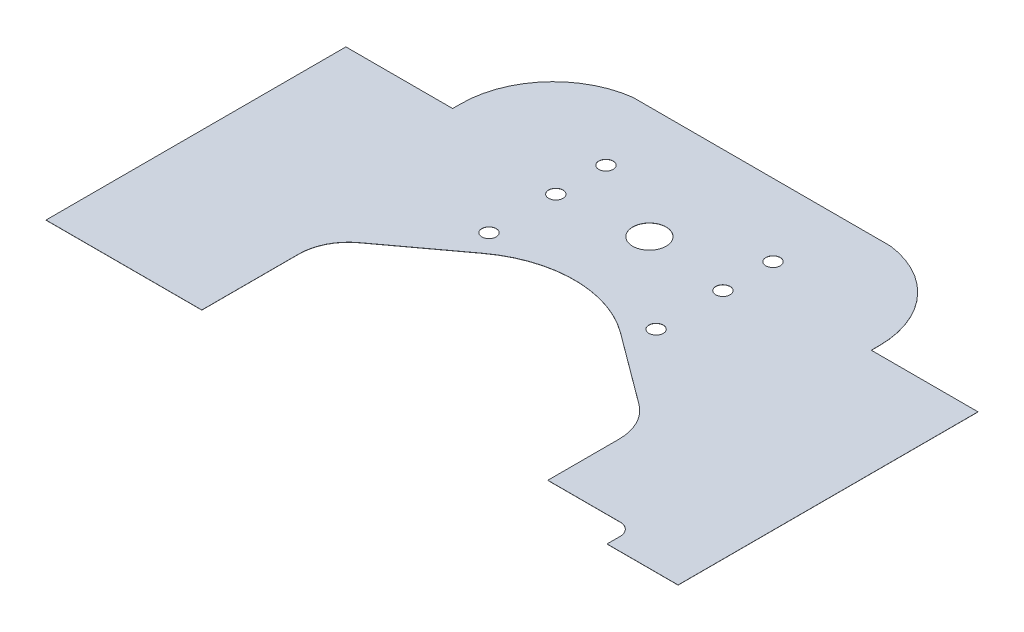
ISO-10303-21;
HEADER;
FILE_DESCRIPTION(('STEP AP214'),'2;1');
FILE_NAME('part.step','',(''),(''),'','','');
FILE_SCHEMA(('AUTOMOTIVE_DESIGN { 1 0 10303 214 1 1 1 1 }'));
ENDSEC;
DATA;
#1=APPLICATION_CONTEXT('core data for automotive mechanical design processes');
#2=APPLICATION_PROTOCOL_DEFINITION('international standard','automotive_design',2000,#1);
#3=PRODUCT_CONTEXT('',#1,'mechanical');
#4=PRODUCT('Part','Part','',(#3));
#5=PRODUCT_RELATED_PRODUCT_CATEGORY('part','',(#4));
#6=PRODUCT_DEFINITION_FORMATION('','',#4);
#7=PRODUCT_DEFINITION_CONTEXT('part definition',#1,'design');
#8=PRODUCT_DEFINITION('design','',#6,#7);
#9=PRODUCT_DEFINITION_SHAPE('','',#8);
#10=(LENGTH_UNIT() NAMED_UNIT(*) SI_UNIT(.MILLI.,.METRE.));
#11=(NAMED_UNIT(*) PLANE_ANGLE_UNIT() SI_UNIT($,.RADIAN.));
#12=(NAMED_UNIT(*) SI_UNIT($,.STERADIAN.) SOLID_ANGLE_UNIT());
#13=UNCERTAINTY_MEASURE_WITH_UNIT(LENGTH_MEASURE(1.E-05),#10,'distance_accuracy_value','');
#14=(GEOMETRIC_REPRESENTATION_CONTEXT(3) GLOBAL_UNCERTAINTY_ASSIGNED_CONTEXT((#13)) GLOBAL_UNIT_ASSIGNED_CONTEXT((#10,
#11,#12)) REPRESENTATION_CONTEXT('',''));
#15=CARTESIAN_POINT('',(0.,0.,0.));
#16=DIRECTION('',(0.,0.,1.));
#17=DIRECTION('',(1.,0.,0.));
#18=AXIS2_PLACEMENT_3D('',#15,#16,#17);
#19=CARTESIAN_POINT('',(44.2056152255693,0.0254,52.1025238036352));
#20=DIRECTION('',(0.,1.,0.));
#21=DIRECTION('',(0.,0.,1.));
#22=AXIS2_PLACEMENT_3D('',#19,#20,#21);
#23=PLANE('',#22);
#24=DIRECTION('',(-1.,0.,0.));
#25=VECTOR('',#24,1.);
#26=CARTESIAN_POINT('',(-60.06,0.0254,54.6058051868823));
#27=LINE('',#26,#25);
#28=CARTESIAN_POINT('',(-30.448964566714,0.0254,54.6058051868823));
#29=VERTEX_POINT('',#28);
#30=CARTESIAN_POINT('',(-60.06,0.0254,54.6058051868823));
#31=VERTEX_POINT('',#30);
#32=EDGE_CURVE('E46',#29,#31,#27,.T.);
#33=ORIENTED_EDGE('',*,*,#32,.F.);
#34=DIRECTION('',(0.,0.,1.));
#35=VECTOR('',#34,1.);
#36=CARTESIAN_POINT('',(-30.448964566714,0.0254,54.6058051868823));
#37=LINE('',#36,#35);
#38=CARTESIAN_POINT('',(-30.4489645667141,0.0254,36.195));
#39=VERTEX_POINT('',#38);
#40=EDGE_CURVE('E281',#39,#29,#37,.T.);
#41=ORIENTED_EDGE('',*,*,#40,.F.);
#42=CARTESIAN_POINT('',(-21.,0.0254,36.195));
#43=DIRECTION('',(0.,1.,0.));
#44=DIRECTION('',(0.,0.,1.));
#45=AXIS2_PLACEMENT_3D('',#42,#43,#44);
#46=CIRCLE('',#45,9.44896456671407);
#47=CARTESIAN_POINT('',(-26.6243836706632,0.0254,28.6022903579686));
#48=VERTEX_POINT('',#47);
#49=EDGE_CURVE('E284',#48,#39,#46,.T.);
#50=ORIENTED_EDGE('',*,*,#49,.F.);
#51=DIRECTION('',(-0.803549382413627,0.,0.595238095238098));
#52=VECTOR('',#51,1.);
#53=CARTESIAN_POINT('',(-26.6243836706632,0.0254,28.6022903579686));
#54=LINE('',#53,#52);
#55=CARTESIAN_POINT('',(-13.0648598611394,0.0254,18.5579230777982));
#56=VERTEX_POINT('',#55);
#57=EDGE_CURVE('E287',#56,#48,#54,.T.);
#58=ORIENTED_EDGE('',*,*,#57,.F.);
#59=CARTESIAN_POINT('',(0.,0.0254,36.195));
#60=DIRECTION('',(0.,1.,0.));
#61=DIRECTION('',(0.,0.,1.));
#62=AXIS2_PLACEMENT_3D('',#59,#60,#61);
#63=CIRCLE('',#62,21.9489645667142);
#64=CARTESIAN_POINT('',(13.0648598611394,0.0254,18.5579230777982));
#65=VERTEX_POINT('',#64);
#66=EDGE_CURVE('E290',#65,#56,#63,.T.);
#67=ORIENTED_EDGE('',*,*,#66,.F.);
#68=DIRECTION('',(-0.80354938241363,0.,-0.595238095238094));
#69=VECTOR('',#68,1.);
#70=CARTESIAN_POINT('',(13.0648598611394,0.0254,18.5579230777982));
#71=LINE('',#70,#69);
#72=CARTESIAN_POINT('',(26.6243836706632,0.0254,28.6022903579686));
#73=VERTEX_POINT('',#72);
#74=EDGE_CURVE('E293',#73,#65,#71,.T.);
#75=ORIENTED_EDGE('',*,*,#74,.F.);
#76=CARTESIAN_POINT('',(21.,0.0254,36.195));
#77=DIRECTION('',(0.,1.,0.));
#78=DIRECTION('',(0.,0.,1.));
#79=AXIS2_PLACEMENT_3D('',#76,#77,#78);
#80=CIRCLE('',#79,9.44896456671417);
#81=CARTESIAN_POINT('',(30.4489645667142,0.0254,36.195));
#82=VERTEX_POINT('',#81);
#83=EDGE_CURVE('E296',#82,#73,#80,.T.);
#84=ORIENTED_EDGE('',*,*,#83,.F.);
#85=DIRECTION('',(0.,0.,-1.));
#86=VECTOR('',#85,1.);
#87=CARTESIAN_POINT('',(30.4489645667142,0.0254,36.195));
#88=LINE('',#87,#86);
#89=CARTESIAN_POINT('',(30.4489645667141,0.0254,49.7525578130592));
#90=VERTEX_POINT('',#89);
#91=EDGE_CURVE('E299',#90,#82,#88,.T.);
#92=ORIENTED_EDGE('',*,*,#91,.F.);
#93=DIRECTION('',(-1.,0.,0.));
#94=VECTOR('',#93,1.);
#95=CARTESIAN_POINT('',(30.4489645667141,0.0254,49.7525578130592));
#96=LINE('',#95,#94);
#97=CARTESIAN_POINT('',(44.2056152255693,0.0254,49.7525578130594));
#98=VERTEX_POINT('',#97);
#99=EDGE_CURVE('E302',#98,#90,#96,.T.);
#100=ORIENTED_EDGE('',*,*,#99,.F.);
#101=CARTESIAN_POINT('',(44.2056152255693,0.0254,52.1025238036352));
#102=DIRECTION('',(0.,1.,0.));
#103=DIRECTION('',(0.,0.,1.));
#104=AXIS2_PLACEMENT_3D('',#101,#102,#103);
#105=CIRCLE('',#104,2.34996599057581);
#106=CARTESIAN_POINT('',(46.5555812161449,0.0254,52.102523803633));
#107=VERTEX_POINT('',#106);
#108=EDGE_CURVE('E305',#107,#98,#105,.T.);
#109=ORIENTED_EDGE('',*,*,#108,.F.);
#110=DIRECTION('',(1.71858994726284E-13,0.,-1.));
#111=VECTOR('',#110,1.);
#112=CARTESIAN_POINT('',(46.5555812161449,0.0254,52.102523803633));
#113=LINE('',#112,#111);
#114=CARTESIAN_POINT('',(46.5555812161444,0.0254,54.6058051868823));
#115=VERTEX_POINT('',#114);
#116=EDGE_CURVE('E308',#115,#107,#113,.T.);
#117=ORIENTED_EDGE('',*,*,#116,.F.);
#118=DIRECTION('',(-1.,0.,0.));
#119=VECTOR('',#118,1.);
#120=CARTESIAN_POINT('',(46.5555812161444,0.0254,54.6058051868823));
#121=LINE('',#120,#119);
#122=CARTESIAN_POINT('',(60.0599999999974,0.0254,54.6058051868823));
#123=VERTEX_POINT('',#122);
#124=EDGE_CURVE('E311',#123,#115,#121,.T.);
#125=ORIENTED_EDGE('',*,*,#124,.F.);
#126=DIRECTION('',(0.,0.,-1.));
#127=VECTOR('',#126,1.);
#128=CARTESIAN_POINT('',(60.0599999999974,0.0254,55.1058051868806));
#129=LINE('',#128,#127);
#130=CARTESIAN_POINT('',(60.0599999999974,0.0254,-2.38250000000009));
#131=VERTEX_POINT('',#130);
#132=EDGE_CURVE('E96',#123,#131,#129,.T.);
#133=ORIENTED_EDGE('',*,*,#132,.T.);
#134=DIRECTION('',(-1.,0.,0.));
#135=VECTOR('',#134,1.);
#136=CARTESIAN_POINT('',(60.0599999999974,0.0254,-2.38250000000009));
#137=LINE('',#136,#135);
#138=CARTESIAN_POINT('',(39.775,0.0254,-2.38250000000009));
#139=VERTEX_POINT('',#138);
#140=EDGE_CURVE('E197',#131,#139,#137,.T.);
#141=ORIENTED_EDGE('',*,*,#140,.T.);
#142=DIRECTION('',(0.,0.,-1.));
#143=VECTOR('',#142,1.);
#144=CARTESIAN_POINT('',(39.775,0.0254,-2.38250000000009));
#145=LINE('',#144,#143);
#146=CARTESIAN_POINT('',(39.775,0.0254,-3.94250000000058));
#147=VERTEX_POINT('',#146);
#148=EDGE_CURVE('E176',#139,#147,#145,.T.);
#149=ORIENTED_EDGE('',*,*,#148,.T.);
#150=CARTESIAN_POINT('',(22.225,0.0254,-3.94250000000058));
#151=DIRECTION('',(0.,1.,0.));
#152=DIRECTION('',(0.,0.,1.));
#153=AXIS2_PLACEMENT_3D('',#150,#151,#152);
#154=CIRCLE('',#153,17.55);
#155=CARTESIAN_POINT('',(24.4755336439552,0.0254,-21.3476026517354));
#156=VERTEX_POINT('',#155);
#157=EDGE_CURVE('E193',#147,#156,#154,.T.);
#158=ORIENTED_EDGE('',*,*,#157,.T.);
#159=DIRECTION('',(-1.,0.,0.));
#160=VECTOR('',#159,1.);
#161=CARTESIAN_POINT('',(-24.4755336439552,0.0254,-21.3476026517354));
#162=LINE('',#161,#160);
#163=CARTESIAN_POINT('',(-24.4755336439552,0.0254,-21.3476026517354));
#164=VERTEX_POINT('',#163);
#165=EDGE_CURVE('E120',#156,#164,#162,.T.);
#166=ORIENTED_EDGE('',*,*,#165,.T.);
#167=CARTESIAN_POINT('',(-22.225,0.0254,-3.94250000000058));
#168=DIRECTION('',(0.,1.,0.));
#169=DIRECTION('',(0.,0.,1.));
#170=AXIS2_PLACEMENT_3D('',#167,#168,#169);
#171=CIRCLE('',#170,17.55);
#172=CARTESIAN_POINT('',(-39.775,0.0254,-3.94250000000059));
#173=VERTEX_POINT('',#172);
#174=EDGE_CURVE('E113',#164,#173,#171,.T.);
#175=ORIENTED_EDGE('',*,*,#174,.T.);
#176=DIRECTION('',(0.,0.,1.));
#177=VECTOR('',#176,1.);
#178=CARTESIAN_POINT('',(-39.775,0.0254,-3.94250000000058));
#179=LINE('',#178,#177);
#180=CARTESIAN_POINT('',(-39.775,0.0254,-2.38250000000009));
#181=VERTEX_POINT('',#180);
#182=EDGE_CURVE('E117',#173,#181,#179,.T.);
#183=ORIENTED_EDGE('',*,*,#182,.T.);
#184=DIRECTION('',(-1.,0.,0.));
#185=VECTOR('',#184,1.);
#186=CARTESIAN_POINT('',(-39.775,0.0254,-2.38250000000009));
#187=LINE('',#186,#185);
#188=CARTESIAN_POINT('',(-60.06,0.0254,-2.38250000000009));
#189=VERTEX_POINT('',#188);
#190=EDGE_CURVE('E55',#181,#189,#187,.T.);
#191=ORIENTED_EDGE('',*,*,#190,.T.);
#192=DIRECTION('',(0.,0.,1.));
#193=VECTOR('',#192,1.);
#194=CARTESIAN_POINT('',(-60.06,0.0254,-2.38250000000009));
#195=LINE('',#194,#193);
#196=EDGE_CURVE('E137',#189,#31,#195,.T.);
#197=ORIENTED_EDGE('',*,*,#196,.T.);
#198=EDGE_LOOP('',(#33,#41,#50,#58,#67,#75,#84,#92,#100,#109,#117,#125,#133,#141,#149,#158,#166,
#175,#183,#191,#197));
#199=FACE_BOUND('',#198,.T.);
#200=CARTESIAN_POINT('',(15.875,0.0254,-7.62000000000004));
#201=DIRECTION('',(0.,1.,0.));
#202=DIRECTION('',(0.,0.,1.));
#203=AXIS2_PLACEMENT_3D('',#200,#201,#202);
#204=CIRCLE('',#203,1.36999999999998);
#205=CARTESIAN_POINT('',(15.875,0.0254,-6.25000000000006));
#206=VERTEX_POINT('',#205);
#207=EDGE_CURVE('E227',#206,#206,#204,.T.);
#208=ORIENTED_EDGE('',*,*,#207,.F.);
#209=EDGE_LOOP('',(#208));
#210=FACE_BOUND('',#209,.T.);
#211=CARTESIAN_POINT('',(0.,0.0254,0.));
#212=DIRECTION('',(0.,1.,0.));
#213=DIRECTION('',(0.,0.,1.));
#214=AXIS2_PLACEMENT_3D('',#211,#212,#213);
#215=CIRCLE('',#214,3.175);
#216=CARTESIAN_POINT('',(0.,0.0254,3.175));
#217=VERTEX_POINT('',#216);
#218=EDGE_CURVE('E215',#217,#217,#215,.T.);
#219=ORIENTED_EDGE('',*,*,#218,.F.);
#220=EDGE_LOOP('',(#219));
#221=FACE_BOUND('',#220,.T.);
#222=CARTESIAN_POINT('',(-15.875,0.0254,-7.62000000000004));
#223=DIRECTION('',(0.,1.,0.));
#224=DIRECTION('',(0.,0.,1.));
#225=AXIS2_PLACEMENT_3D('',#222,#223,#224);
#226=CIRCLE('',#225,1.37);
#227=CARTESIAN_POINT('',(-15.875,0.0254,-6.25000000000005));
#228=VERTEX_POINT('',#227);
#229=EDGE_CURVE('E203',#228,#228,#226,.T.);
#230=ORIENTED_EDGE('',*,*,#229,.F.);
#231=EDGE_LOOP('',(#230));
#232=FACE_BOUND('',#231,.T.);
#233=CARTESIAN_POINT('',(-15.875,0.0254,1.90499999999996));
#234=DIRECTION('',(0.,1.,0.));
#235=DIRECTION('',(0.,0.,1.));
#236=AXIS2_PLACEMENT_3D('',#233,#234,#235);
#237=CIRCLE('',#236,1.37);
#238=CARTESIAN_POINT('',(-15.875,0.0254,3.27499999999996));
#239=VERTEX_POINT('',#238);
#240=EDGE_CURVE('E146',#239,#239,#237,.T.);
#241=ORIENTED_EDGE('',*,*,#240,.F.);
#242=EDGE_LOOP('',(#241));
#243=FACE_BOUND('',#242,.T.);
#244=CARTESIAN_POINT('',(-15.875,0.0254,14.605));
#245=DIRECTION('',(0.,1.,0.));
#246=DIRECTION('',(0.,0.,1.));
#247=AXIS2_PLACEMENT_3D('',#244,#245,#246);
#248=CIRCLE('',#247,1.37);
#249=CARTESIAN_POINT('',(-15.875,0.0254,15.975));
#250=VERTEX_POINT('',#249);
#251=EDGE_CURVE('E209',#250,#250,#248,.T.);
#252=ORIENTED_EDGE('',*,*,#251,.F.);
#253=EDGE_LOOP('',(#252));
#254=FACE_BOUND('',#253,.T.);
#255=CARTESIAN_POINT('',(15.875,0.0254,1.90499999999996));
#256=DIRECTION('',(0.,1.,0.));
#257=DIRECTION('',(0.,0.,1.));
#258=AXIS2_PLACEMENT_3D('',#255,#256,#257);
#259=CIRCLE('',#258,1.36999999999998);
#260=CARTESIAN_POINT('',(15.875,0.0254,3.27499999999995));
#261=VERTEX_POINT('',#260);
#262=EDGE_CURVE('E221',#261,#261,#259,.T.);
#263=ORIENTED_EDGE('',*,*,#262,.F.);
#264=EDGE_LOOP('',(#263));
#265=FACE_BOUND('',#264,.T.);
#266=CARTESIAN_POINT('',(15.875,0.0254,14.605));
#267=DIRECTION('',(0.,1.,0.));
#268=DIRECTION('',(0.,0.,1.));
#269=AXIS2_PLACEMENT_3D('',#266,#267,#268);
#270=CIRCLE('',#269,1.36999999999998);
#271=CARTESIAN_POINT('',(15.875,0.0254,15.975));
#272=VERTEX_POINT('',#271);
#273=EDGE_CURVE('E233',#272,#272,#270,.T.);
#274=ORIENTED_EDGE('',*,*,#273,.F.);
#275=EDGE_LOOP('',(#274));
#276=FACE_BOUND('',#275,.T.);
#277=ADVANCED_FACE('F31',(#199,#210,#221,#232,#243,#254,#265,#276),#23,.T.);
#278=CARTESIAN_POINT('',(44.2056152255693,0.,52.1025238036352));
#279=DIRECTION('',(0.,1.,0.));
#280=DIRECTION('',(0.,0.,1.));
#281=AXIS2_PLACEMENT_3D('',#278,#279,#280);
#282=PLANE('',#281);
#283=CARTESIAN_POINT('',(15.875,0.,-7.62000000000004));
#284=DIRECTION('',(0.,1.,0.));
#285=DIRECTION('',(0.,0.,1.));
#286=AXIS2_PLACEMENT_3D('',#283,#284,#285);
#287=CIRCLE('',#286,1.36999999999998);
#288=CARTESIAN_POINT('',(15.875,0.,-6.25000000000006));
#289=VERTEX_POINT('',#288);
#290=EDGE_CURVE('E230',#289,#289,#287,.T.);
#291=ORIENTED_EDGE('',*,*,#290,.T.);
#292=EDGE_LOOP('',(#291));
#293=FACE_BOUND('',#292,.T.);
#294=CARTESIAN_POINT('',(0.,0.,0.));
#295=DIRECTION('',(0.,1.,0.));
#296=DIRECTION('',(0.,0.,1.));
#297=AXIS2_PLACEMENT_3D('',#294,#295,#296);
#298=CIRCLE('',#297,3.175);
#299=CARTESIAN_POINT('',(0.,0.,3.175));
#300=VERTEX_POINT('',#299);
#301=EDGE_CURVE('E218',#300,#300,#298,.T.);
#302=ORIENTED_EDGE('',*,*,#301,.T.);
#303=EDGE_LOOP('',(#302));
#304=FACE_BOUND('',#303,.T.);
#305=CARTESIAN_POINT('',(-15.875,0.,-7.62000000000004));
#306=DIRECTION('',(0.,1.,0.));
#307=DIRECTION('',(0.,0.,1.));
#308=AXIS2_PLACEMENT_3D('',#305,#306,#307);
#309=CIRCLE('',#308,1.37);
#310=CARTESIAN_POINT('',(-15.875,0.,-6.25000000000005));
#311=VERTEX_POINT('',#310);
#312=EDGE_CURVE('E206',#311,#311,#309,.T.);
#313=ORIENTED_EDGE('',*,*,#312,.T.);
#314=EDGE_LOOP('',(#313));
#315=FACE_BOUND('',#314,.T.);
#316=DIRECTION('',(0.,0.,1.));
#317=VECTOR('',#316,1.);
#318=CARTESIAN_POINT('',(-30.448964566714,0.,54.6058051868823));
#319=LINE('',#318,#317);
#320=CARTESIAN_POINT('',(-30.4489645667141,0.,36.195));
#321=VERTEX_POINT('',#320);
#322=CARTESIAN_POINT('',(-30.448964566714,0.,54.6058051868823));
#323=VERTEX_POINT('',#322);
#324=EDGE_CURVE('E316',#321,#323,#319,.T.);
#325=ORIENTED_EDGE('',*,*,#324,.T.);
#326=DIRECTION('',(-1.,0.,0.));
#327=VECTOR('',#326,1.);
#328=CARTESIAN_POINT('',(-60.06,0.,54.6058051868823));
#329=LINE('',#328,#327);
#330=CARTESIAN_POINT('',(-60.06,0.,54.6058051868823));
#331=VERTEX_POINT('',#330);
#332=EDGE_CURVE('E246',#323,#331,#329,.T.);
#333=ORIENTED_EDGE('',*,*,#332,.T.);
#334=DIRECTION('',(0.,0.,1.));
#335=VECTOR('',#334,1.);
#336=CARTESIAN_POINT('',(-60.06,0.,-2.38250000000009));
#337=LINE('',#336,#335);
#338=CARTESIAN_POINT('',(-60.06,0.,-2.38250000000009));
#339=VERTEX_POINT('',#338);
#340=EDGE_CURVE('E158',#339,#331,#337,.T.);
#341=ORIENTED_EDGE('',*,*,#340,.F.);
#342=DIRECTION('',(-1.,0.,0.));
#343=VECTOR('',#342,1.);
#344=CARTESIAN_POINT('',(-39.775,0.,-2.38250000000009));
#345=LINE('',#344,#343);
#346=CARTESIAN_POINT('',(-39.775,0.,-2.38250000000009));
#347=VERTEX_POINT('',#346);
#348=EDGE_CURVE('E88',#347,#339,#345,.T.);
#349=ORIENTED_EDGE('',*,*,#348,.F.);
#350=DIRECTION('',(0.,0.,1.));
#351=VECTOR('',#350,1.);
#352=CARTESIAN_POINT('',(-39.775,0.,-3.94250000000058));
#353=LINE('',#352,#351);
#354=CARTESIAN_POINT('',(-39.775,0.,-3.94250000000059));
#355=VERTEX_POINT('',#354);
#356=EDGE_CURVE('E155',#355,#347,#353,.T.);
#357=ORIENTED_EDGE('',*,*,#356,.F.);
#358=CARTESIAN_POINT('',(-22.225,0.,-3.94250000000058));
#359=DIRECTION('',(0.,1.,0.));
#360=DIRECTION('',(0.,0.,1.));
#361=AXIS2_PLACEMENT_3D('',#358,#359,#360);
#362=CIRCLE('',#361,17.55);
#363=CARTESIAN_POINT('',(-24.4755336439552,0.,-21.3476026517354));
#364=VERTEX_POINT('',#363);
#365=EDGE_CURVE('E129',#364,#355,#362,.T.);
#366=ORIENTED_EDGE('',*,*,#365,.F.);
#367=DIRECTION('',(-1.,0.,0.));
#368=VECTOR('',#367,1.);
#369=CARTESIAN_POINT('',(-24.4755336439552,0.,-21.3476026517354));
#370=LINE('',#369,#368);
#371=CARTESIAN_POINT('',(24.4755336439552,0.,-21.3476026517354));
#372=VERTEX_POINT('',#371);
#373=EDGE_CURVE('E152',#372,#364,#370,.T.);
#374=ORIENTED_EDGE('',*,*,#373,.F.);
#375=CARTESIAN_POINT('',(22.225,0.,-3.94250000000058));
#376=DIRECTION('',(0.,1.,0.));
#377=DIRECTION('',(0.,0.,1.));
#378=AXIS2_PLACEMENT_3D('',#375,#376,#377);
#379=CIRCLE('',#378,17.55);
#380=CARTESIAN_POINT('',(39.775,0.,-3.94250000000058));
#381=VERTEX_POINT('',#380);
#382=EDGE_CURVE('E150',#381,#372,#379,.T.);
#383=ORIENTED_EDGE('',*,*,#382,.F.);
#384=DIRECTION('',(0.,0.,-1.));
#385=VECTOR('',#384,1.);
#386=CARTESIAN_POINT('',(39.775,0.,-2.38250000000009));
#387=LINE('',#386,#385);
#388=CARTESIAN_POINT('',(39.775,0.,-2.38250000000009));
#389=VERTEX_POINT('',#388);
#390=EDGE_CURVE('E148',#389,#381,#387,.T.);
#391=ORIENTED_EDGE('',*,*,#390,.F.);
#392=DIRECTION('',(-1.,0.,0.));
#393=VECTOR('',#392,1.);
#394=CARTESIAN_POINT('',(60.0599999999974,0.,-2.38250000000009));
#395=LINE('',#394,#393);
#396=CARTESIAN_POINT('',(60.0599999999974,0.,-2.38250000000009));
#397=VERTEX_POINT('',#396);
#398=EDGE_CURVE('E145',#397,#389,#395,.T.);
#399=ORIENTED_EDGE('',*,*,#398,.F.);
#400=DIRECTION('',(0.,0.,-1.));
#401=VECTOR('',#400,1.);
#402=CARTESIAN_POINT('',(60.0599999999974,0.,55.1058051868806));
#403=LINE('',#402,#401);
#404=CARTESIAN_POINT('',(60.0599999999974,0.,54.6058051868823));
#405=VERTEX_POINT('',#404);
#406=EDGE_CURVE('E143',#405,#397,#403,.T.);
#407=ORIENTED_EDGE('',*,*,#406,.F.);
#408=DIRECTION('',(-1.,0.,0.));
#409=VECTOR('',#408,1.);
#410=CARTESIAN_POINT('',(46.5555812161444,0.,54.6058051868823));
#411=LINE('',#410,#409);
#412=CARTESIAN_POINT('',(46.5555812161444,0.,54.6058051868823));
#413=VERTEX_POINT('',#412);
#414=EDGE_CURVE('E280',#405,#413,#411,.T.);
#415=ORIENTED_EDGE('',*,*,#414,.T.);
#416=DIRECTION('',(1.71858994726284E-13,0.,-1.));
#417=VECTOR('',#416,1.);
#418=CARTESIAN_POINT('',(46.5555812161449,0.,52.102523803633));
#419=LINE('',#418,#417);
#420=CARTESIAN_POINT('',(46.5555812161449,0.,52.102523803633));
#421=VERTEX_POINT('',#420);
#422=EDGE_CURVE('E342',#413,#421,#419,.T.);
#423=ORIENTED_EDGE('',*,*,#422,.T.);
#424=CARTESIAN_POINT('',(44.2056152255693,0.,52.1025238036352));
#425=DIRECTION('',(0.,1.,0.));
#426=DIRECTION('',(0.,0.,1.));
#427=AXIS2_PLACEMENT_3D('',#424,#425,#426);
#428=CIRCLE('',#427,2.34996599057581);
#429=CARTESIAN_POINT('',(44.2056152255693,0.,49.7525578130594));
#430=VERTEX_POINT('',#429);
#431=EDGE_CURVE('E339',#421,#430,#428,.T.);
#432=ORIENTED_EDGE('',*,*,#431,.T.);
#433=DIRECTION('',(-1.,0.,0.));
#434=VECTOR('',#433,1.);
#435=CARTESIAN_POINT('',(30.4489645667141,0.,49.7525578130592));
#436=LINE('',#435,#434);
#437=CARTESIAN_POINT('',(30.4489645667141,0.,49.7525578130592));
#438=VERTEX_POINT('',#437);
#439=EDGE_CURVE('E336',#430,#438,#436,.T.);
#440=ORIENTED_EDGE('',*,*,#439,.T.);
#441=DIRECTION('',(0.,0.,-1.));
#442=VECTOR('',#441,1.);
#443=CARTESIAN_POINT('',(30.4489645667142,0.,36.195));
#444=LINE('',#443,#442);
#445=CARTESIAN_POINT('',(30.4489645667142,0.,36.195));
#446=VERTEX_POINT('',#445);
#447=EDGE_CURVE('E333',#438,#446,#444,.T.);
#448=ORIENTED_EDGE('',*,*,#447,.T.);
#449=CARTESIAN_POINT('',(21.,0.,36.195));
#450=DIRECTION('',(0.,1.,0.));
#451=DIRECTION('',(0.,0.,1.));
#452=AXIS2_PLACEMENT_3D('',#449,#450,#451);
#453=CIRCLE('',#452,9.44896456671417);
#454=CARTESIAN_POINT('',(26.6243836706632,0.,28.6022903579686));
#455=VERTEX_POINT('',#454);
#456=EDGE_CURVE('E330',#446,#455,#453,.T.);
#457=ORIENTED_EDGE('',*,*,#456,.T.);
#458=DIRECTION('',(-0.80354938241363,0.,-0.595238095238094));
#459=VECTOR('',#458,1.);
#460=CARTESIAN_POINT('',(13.0648598611394,0.,18.5579230777982));
#461=LINE('',#460,#459);
#462=CARTESIAN_POINT('',(13.0648598611394,0.,18.5579230777982));
#463=VERTEX_POINT('',#462);
#464=EDGE_CURVE('E327',#455,#463,#461,.T.);
#465=ORIENTED_EDGE('',*,*,#464,.T.);
#466=CARTESIAN_POINT('',(0.,0.,36.195));
#467=DIRECTION('',(0.,1.,0.));
#468=DIRECTION('',(0.,0.,1.));
#469=AXIS2_PLACEMENT_3D('',#466,#467,#468);
#470=CIRCLE('',#469,21.9489645667142);
#471=CARTESIAN_POINT('',(-13.0648598611394,0.,18.5579230777982));
#472=VERTEX_POINT('',#471);
#473=EDGE_CURVE('E324',#463,#472,#470,.T.);
#474=ORIENTED_EDGE('',*,*,#473,.T.);
#475=DIRECTION('',(-0.803549382413627,0.,0.595238095238098));
#476=VECTOR('',#475,1.);
#477=CARTESIAN_POINT('',(-26.6243836706632,0.,28.6022903579686));
#478=LINE('',#477,#476);
#479=CARTESIAN_POINT('',(-26.6243836706632,0.,28.6022903579686));
#480=VERTEX_POINT('',#479);
#481=EDGE_CURVE('E321',#472,#480,#478,.T.);
#482=ORIENTED_EDGE('',*,*,#481,.T.);
#483=CARTESIAN_POINT('',(-21.,0.,36.195));
#484=DIRECTION('',(0.,1.,0.));
#485=DIRECTION('',(0.,0.,1.));
#486=AXIS2_PLACEMENT_3D('',#483,#484,#485);
#487=CIRCLE('',#486,9.44896456671407);
#488=EDGE_CURVE('E318',#480,#321,#487,.T.);
#489=ORIENTED_EDGE('',*,*,#488,.T.);
#490=EDGE_LOOP('',(#325,#333,#341,#349,#357,#366,#374,#383,#391,#399,#407,#415,#423,#432,#440,
#448,#457,#465,#474,#482,#489));
#491=FACE_BOUND('',#490,.T.);
#492=CARTESIAN_POINT('',(-15.875,0.,1.90499999999996));
#493=DIRECTION('',(0.,1.,0.));
#494=DIRECTION('',(0.,0.,1.));
#495=AXIS2_PLACEMENT_3D('',#492,#493,#494);
#496=CIRCLE('',#495,1.37);
#497=CARTESIAN_POINT('',(-15.875,0.,3.27499999999996));
#498=VERTEX_POINT('',#497);
#499=EDGE_CURVE('E200',#498,#498,#496,.T.);
#500=ORIENTED_EDGE('',*,*,#499,.T.);
#501=EDGE_LOOP('',(#500));
#502=FACE_BOUND('',#501,.T.);
#503=CARTESIAN_POINT('',(-15.875,0.,14.605));
#504=DIRECTION('',(0.,1.,0.));
#505=DIRECTION('',(0.,0.,1.));
#506=AXIS2_PLACEMENT_3D('',#503,#504,#505);
#507=CIRCLE('',#506,1.37);
#508=CARTESIAN_POINT('',(-15.875,0.,15.975));
#509=VERTEX_POINT('',#508);
#510=EDGE_CURVE('E212',#509,#509,#507,.T.);
#511=ORIENTED_EDGE('',*,*,#510,.T.);
#512=EDGE_LOOP('',(#511));
#513=FACE_BOUND('',#512,.T.);
#514=CARTESIAN_POINT('',(15.875,0.,1.90499999999996));
#515=DIRECTION('',(0.,1.,0.));
#516=DIRECTION('',(0.,0.,1.));
#517=AXIS2_PLACEMENT_3D('',#514,#515,#516);
#518=CIRCLE('',#517,1.36999999999998);
#519=CARTESIAN_POINT('',(15.875,0.,3.27499999999995));
#520=VERTEX_POINT('',#519);
#521=EDGE_CURVE('E224',#520,#520,#518,.T.);
#522=ORIENTED_EDGE('',*,*,#521,.T.);
#523=EDGE_LOOP('',(#522));
#524=FACE_BOUND('',#523,.T.);
#525=CARTESIAN_POINT('',(15.875,0.,14.605));
#526=DIRECTION('',(0.,1.,0.));
#527=DIRECTION('',(0.,0.,1.));
#528=AXIS2_PLACEMENT_3D('',#525,#526,#527);
#529=CIRCLE('',#528,1.36999999999998);
#530=CARTESIAN_POINT('',(15.875,0.,15.975));
#531=VERTEX_POINT('',#530);
#532=EDGE_CURVE('E236',#531,#531,#529,.T.);
#533=ORIENTED_EDGE('',*,*,#532,.T.);
#534=EDGE_LOOP('',(#533));
#535=FACE_BOUND('',#534,.T.);
#536=ADVANCED_FACE('F183',(#293,#304,#315,#491,#502,#513,#524,#535),#282,.F.);
#537=CARTESIAN_POINT('',(60.0599999999974,0.0254,55.1058051868806));
#538=DIRECTION('',(-1.,0.,0.));
#539=DIRECTION('',(0.,0.,1.));
#540=AXIS2_PLACEMENT_3D('',#537,#538,#539);
#541=PLANE('',#540);
#542=ORIENTED_EDGE('',*,*,#132,.F.);
#543=DIRECTION('',(0.,1.,0.));
#544=VECTOR('',#543,1.);
#545=CARTESIAN_POINT('',(60.0599999999974,0.,54.6058051868823));
#546=LINE('',#545,#544);
#547=EDGE_CURVE('E242',#405,#123,#546,.T.);
#548=ORIENTED_EDGE('',*,*,#547,.F.);
#549=ORIENTED_EDGE('',*,*,#406,.T.);
#550=DIRECTION('',(0.,-1.,0.));
#551=VECTOR('',#550,1.);
#552=CARTESIAN_POINT('',(60.0599999999974,0.0254,-2.38250000000009));
#553=LINE('',#552,#551);
#554=EDGE_CURVE('E11',#131,#397,#553,.T.);
#555=ORIENTED_EDGE('',*,*,#554,.F.);
#556=EDGE_LOOP('',(#542,#548,#549,#555));
#557=FACE_BOUND('',#556,.T.);
#558=ADVANCED_FACE('F33',(#557),#541,.F.);
#559=CARTESIAN_POINT('',(60.0599999999974,0.0254,-2.38250000000009));
#560=DIRECTION('',(0.,0.,1.));
#561=DIRECTION('',(1.,0.,0.));
#562=AXIS2_PLACEMENT_3D('',#559,#560,#561);
#563=PLANE('',#562);
#564=ORIENTED_EDGE('',*,*,#398,.T.);
#565=DIRECTION('',(0.,-1.,0.));
#566=VECTOR('',#565,1.);
#567=CARTESIAN_POINT('',(39.775,0.0254,-2.38250000000009));
#568=LINE('',#567,#566);
#569=EDGE_CURVE('E39',#139,#389,#568,.T.);
#570=ORIENTED_EDGE('',*,*,#569,.F.);
#571=ORIENTED_EDGE('',*,*,#140,.F.);
#572=ORIENTED_EDGE('',*,*,#554,.T.);
#573=EDGE_LOOP('',(#564,#570,#571,#572));
#574=FACE_BOUND('',#573,.T.);
#575=ADVANCED_FACE('F487',(#574),#563,.F.);
#576=CARTESIAN_POINT('',(39.775,0.0254,-2.38250000000009));
#577=DIRECTION('',(-1.,0.,0.));
#578=DIRECTION('',(0.,0.,1.));
#579=AXIS2_PLACEMENT_3D('',#576,#577,#578);
#580=PLANE('',#579);
#581=ORIENTED_EDGE('',*,*,#390,.T.);
#582=DIRECTION('',(0.,-1.,0.));
#583=VECTOR('',#582,1.);
#584=CARTESIAN_POINT('',(39.775,0.0254,-3.94250000000058));
#585=LINE('',#584,#583);
#586=EDGE_CURVE('E167',#147,#381,#585,.T.);
#587=ORIENTED_EDGE('',*,*,#586,.F.);
#588=ORIENTED_EDGE('',*,*,#148,.F.);
#589=ORIENTED_EDGE('',*,*,#569,.T.);
#590=EDGE_LOOP('',(#581,#587,#588,#589));
#591=FACE_BOUND('',#590,.T.);
#592=ADVANCED_FACE('F174',(#591),#580,.F.);
#593=CARTESIAN_POINT('',(22.225,0.0254,-3.94250000000058));
#594=DIRECTION('',(0.,-1.,0.));
#595=DIRECTION('',(0.,0.,-1.));
#596=AXIS2_PLACEMENT_3D('',#593,#594,#595);
#597=CYLINDRICAL_SURFACE('',#596,17.55);
#598=ORIENTED_EDGE('',*,*,#382,.T.);
#599=DIRECTION('',(0.,-1.,0.));
#600=VECTOR('',#599,1.);
#601=CARTESIAN_POINT('',(24.4755336439552,0.0254,-21.3476026517354));
#602=LINE('',#601,#600);
#603=EDGE_CURVE('E164',#156,#372,#602,.T.);
#604=ORIENTED_EDGE('',*,*,#603,.F.);
#605=ORIENTED_EDGE('',*,*,#157,.F.);
#606=ORIENTED_EDGE('',*,*,#586,.T.);
#607=EDGE_LOOP('',(#598,#604,#605,#606));
#608=FACE_BOUND('',#607,.T.);
#609=ADVANCED_FACE('F189',(#608),#597,.T.);
#610=CARTESIAN_POINT('',(-24.4755336439552,0.0254,-21.3476026517354));
#611=DIRECTION('',(0.,0.,1.));
#612=DIRECTION('',(1.,0.,0.));
#613=AXIS2_PLACEMENT_3D('',#610,#611,#612);
#614=PLANE('',#613);
#615=ORIENTED_EDGE('',*,*,#373,.T.);
#616=DIRECTION('',(0.,-1.,0.));
#617=VECTOR('',#616,1.);
#618=CARTESIAN_POINT('',(-24.4755336439552,0.0254,-21.3476026517354));
#619=LINE('',#618,#617);
#620=EDGE_CURVE('E132',#164,#364,#619,.T.);
#621=ORIENTED_EDGE('',*,*,#620,.F.);
#622=ORIENTED_EDGE('',*,*,#165,.F.);
#623=ORIENTED_EDGE('',*,*,#603,.T.);
#624=EDGE_LOOP('',(#615,#621,#622,#623));
#625=FACE_BOUND('',#624,.T.);
#626=ADVANCED_FACE('F192',(#625),#614,.F.);
#627=CARTESIAN_POINT('',(-22.225,0.0254,-3.94250000000058));
#628=DIRECTION('',(0.,-1.,0.));
#629=DIRECTION('',(0.,0.,-1.));
#630=AXIS2_PLACEMENT_3D('',#627,#628,#629);
#631=CYLINDRICAL_SURFACE('',#630,17.55);
#632=ORIENTED_EDGE('',*,*,#365,.T.);
#633=DIRECTION('',(0.,-1.,0.));
#634=VECTOR('',#633,1.);
#635=CARTESIAN_POINT('',(-39.775,0.0254,-3.94250000000059));
#636=LINE('',#635,#634);
#637=EDGE_CURVE('E126',#173,#355,#636,.T.);
#638=ORIENTED_EDGE('',*,*,#637,.F.);
#639=ORIENTED_EDGE('',*,*,#174,.F.);
#640=ORIENTED_EDGE('',*,*,#620,.T.);
#641=EDGE_LOOP('',(#632,#638,#639,#640));
#642=FACE_BOUND('',#641,.T.);
#643=ADVANCED_FACE('F127',(#642),#631,.T.);
#644=CARTESIAN_POINT('',(-39.775,0.0254,-3.94250000000058));
#645=DIRECTION('',(1.,0.,0.));
#646=DIRECTION('',(0.,0.,-1.));
#647=AXIS2_PLACEMENT_3D('',#644,#645,#646);
#648=PLANE('',#647);
#649=ORIENTED_EDGE('',*,*,#356,.T.);
#650=DIRECTION('',(0.,-1.,0.));
#651=VECTOR('',#650,1.);
#652=CARTESIAN_POINT('',(-39.775,0.0254,-2.38250000000009));
#653=LINE('',#652,#651);
#654=EDGE_CURVE('E133',#181,#347,#653,.T.);
#655=ORIENTED_EDGE('',*,*,#654,.F.);
#656=ORIENTED_EDGE('',*,*,#182,.F.);
#657=ORIENTED_EDGE('',*,*,#637,.T.);
#658=EDGE_LOOP('',(#649,#655,#656,#657));
#659=FACE_BOUND('',#658,.T.);
#660=ADVANCED_FACE('F135',(#659),#648,.F.);
#661=CARTESIAN_POINT('',(-39.775,0.0254,-2.38250000000009));
#662=DIRECTION('',(0.,0.,1.));
#663=DIRECTION('',(1.,0.,0.));
#664=AXIS2_PLACEMENT_3D('',#661,#662,#663);
#665=PLANE('',#664);
#666=ORIENTED_EDGE('',*,*,#348,.T.);
#667=DIRECTION('',(0.,-1.,0.));
#668=VECTOR('',#667,1.);
#669=CARTESIAN_POINT('',(-60.06,0.0254,-2.38250000000009));
#670=LINE('',#669,#668);
#671=EDGE_CURVE('E142',#189,#339,#670,.T.);
#672=ORIENTED_EDGE('',*,*,#671,.F.);
#673=ORIENTED_EDGE('',*,*,#190,.F.);
#674=ORIENTED_EDGE('',*,*,#654,.T.);
#675=EDGE_LOOP('',(#666,#672,#673,#674));
#676=FACE_BOUND('',#675,.T.);
#677=ADVANCED_FACE('F475',(#676),#665,.F.);
#678=CARTESIAN_POINT('',(-60.06,0.0254,-2.38250000000009));
#679=DIRECTION('',(1.,0.,0.));
#680=DIRECTION('',(0.,0.,-1.));
#681=AXIS2_PLACEMENT_3D('',#678,#679,#680);
#682=PLANE('',#681);
#683=ORIENTED_EDGE('',*,*,#340,.T.);
#684=DIRECTION('',(0.,1.,0.));
#685=VECTOR('',#684,1.);
#686=CARTESIAN_POINT('',(-60.06,0.,54.6058051868823));
#687=LINE('',#686,#685);
#688=EDGE_CURVE('E239',#331,#31,#687,.T.);
#689=ORIENTED_EDGE('',*,*,#688,.T.);
#690=ORIENTED_EDGE('',*,*,#196,.F.);
#691=ORIENTED_EDGE('',*,*,#671,.T.);
#692=EDGE_LOOP('',(#683,#689,#690,#691));
#693=FACE_BOUND('',#692,.T.);
#694=ADVANCED_FACE('F393',(#693),#682,.F.);
#695=CARTESIAN_POINT('',(-15.875,0.0254,1.90499999999996));
#696=DIRECTION('',(0.,-1.,0.));
#697=DIRECTION('',(0.,0.,-1.));
#698=AXIS2_PLACEMENT_3D('',#695,#696,#697);
#699=CYLINDRICAL_SURFACE('',#698,1.37);
#700=ORIENTED_EDGE('',*,*,#240,.T.);
#701=EDGE_LOOP('',(#700));
#702=FACE_BOUND('',#701,.T.);
#703=ORIENTED_EDGE('',*,*,#499,.F.);
#704=EDGE_LOOP('',(#703));
#705=FACE_BOUND('',#704,.T.);
#706=ADVANCED_FACE('F470',(#702,#705),#699,.F.);
#707=CARTESIAN_POINT('',(-15.875,0.0254,-7.62000000000004));
#708=DIRECTION('',(0.,-1.,0.));
#709=DIRECTION('',(0.,0.,-1.));
#710=AXIS2_PLACEMENT_3D('',#707,#708,#709);
#711=CYLINDRICAL_SURFACE('',#710,1.37);
#712=ORIENTED_EDGE('',*,*,#229,.T.);
#713=EDGE_LOOP('',(#712));
#714=FACE_BOUND('',#713,.T.);
#715=ORIENTED_EDGE('',*,*,#312,.F.);
#716=EDGE_LOOP('',(#715));
#717=FACE_BOUND('',#716,.T.);
#718=ADVANCED_FACE('F555',(#714,#717),#711,.F.);
#719=CARTESIAN_POINT('',(-15.875,0.0254,14.605));
#720=DIRECTION('',(0.,-1.,0.));
#721=DIRECTION('',(0.,0.,-1.));
#722=AXIS2_PLACEMENT_3D('',#719,#720,#721);
#723=CYLINDRICAL_SURFACE('',#722,1.37);
#724=ORIENTED_EDGE('',*,*,#251,.T.);
#725=EDGE_LOOP('',(#724));
#726=FACE_BOUND('',#725,.T.);
#727=ORIENTED_EDGE('',*,*,#510,.F.);
#728=EDGE_LOOP('',(#727));
#729=FACE_BOUND('',#728,.T.);
#730=ADVANCED_FACE('F545',(#726,#729),#723,.F.);
#731=CARTESIAN_POINT('',(0.,0.0254,0.));
#732=DIRECTION('',(0.,-1.,0.));
#733=DIRECTION('',(0.,0.,-1.));
#734=AXIS2_PLACEMENT_3D('',#731,#732,#733);
#735=CYLINDRICAL_SURFACE('',#734,3.175);
#736=ORIENTED_EDGE('',*,*,#218,.T.);
#737=EDGE_LOOP('',(#736));
#738=FACE_BOUND('',#737,.T.);
#739=ORIENTED_EDGE('',*,*,#301,.F.);
#740=EDGE_LOOP('',(#739));
#741=FACE_BOUND('',#740,.T.);
#742=ADVANCED_FACE('F535',(#738,#741),#735,.F.);
#743=CARTESIAN_POINT('',(15.875,0.0254,1.90499999999996));
#744=DIRECTION('',(0.,-1.,0.));
#745=DIRECTION('',(0.,0.,-1.));
#746=AXIS2_PLACEMENT_3D('',#743,#744,#745);
#747=CYLINDRICAL_SURFACE('',#746,1.36999999999998);
#748=ORIENTED_EDGE('',*,*,#262,.T.);
#749=EDGE_LOOP('',(#748));
#750=FACE_BOUND('',#749,.T.);
#751=ORIENTED_EDGE('',*,*,#521,.F.);
#752=EDGE_LOOP('',(#751));
#753=FACE_BOUND('',#752,.T.);
#754=ADVANCED_FACE('F525',(#750,#753),#747,.F.);
#755=CARTESIAN_POINT('',(15.875,0.0254,-7.62000000000004));
#756=DIRECTION('',(0.,-1.,0.));
#757=DIRECTION('',(0.,0.,-1.));
#758=AXIS2_PLACEMENT_3D('',#755,#756,#757);
#759=CYLINDRICAL_SURFACE('',#758,1.36999999999998);
#760=ORIENTED_EDGE('',*,*,#207,.T.);
#761=EDGE_LOOP('',(#760));
#762=FACE_BOUND('',#761,.T.);
#763=ORIENTED_EDGE('',*,*,#290,.F.);
#764=EDGE_LOOP('',(#763));
#765=FACE_BOUND('',#764,.T.);
#766=ADVANCED_FACE('F513',(#762,#765),#759,.F.);
#767=CARTESIAN_POINT('',(15.875,0.0254,14.605));
#768=DIRECTION('',(0.,-1.,0.));
#769=DIRECTION('',(0.,0.,-1.));
#770=AXIS2_PLACEMENT_3D('',#767,#768,#769);
#771=CYLINDRICAL_SURFACE('',#770,1.36999999999998);
#772=ORIENTED_EDGE('',*,*,#273,.T.);
#773=EDGE_LOOP('',(#772));
#774=FACE_BOUND('',#773,.T.);
#775=ORIENTED_EDGE('',*,*,#532,.F.);
#776=EDGE_LOOP('',(#775));
#777=FACE_BOUND('',#776,.T.);
#778=ADVANCED_FACE('F508',(#774,#777),#771,.F.);
#779=CARTESIAN_POINT('',(-60.06,0.,54.6058051868823));
#780=DIRECTION('',(0.,0.,-1.));
#781=DIRECTION('',(-1.,0.,0.));
#782=AXIS2_PLACEMENT_3D('',#779,#780,#781);
#783=PLANE('',#782);
#784=ORIENTED_EDGE('',*,*,#32,.T.);
#785=ORIENTED_EDGE('',*,*,#688,.F.);
#786=ORIENTED_EDGE('',*,*,#332,.F.);
#787=DIRECTION('',(0.,1.,0.));
#788=VECTOR('',#787,1.);
#789=CARTESIAN_POINT('',(-30.448964566714,0.,54.6058051868823));
#790=LINE('',#789,#788);
#791=EDGE_CURVE('E276',#323,#29,#790,.T.);
#792=ORIENTED_EDGE('',*,*,#791,.T.);
#793=EDGE_LOOP('',(#784,#785,#786,#792));
#794=FACE_BOUND('',#793,.T.);
#795=ADVANCED_FACE('F386',(#794),#783,.F.);
#796=CARTESIAN_POINT('',(-30.448964566714,0.,54.6058051868823));
#797=DIRECTION('',(-1.,0.,0.));
#798=DIRECTION('',(0.,0.,1.));
#799=AXIS2_PLACEMENT_3D('',#796,#797,#798);
#800=PLANE('',#799);
#801=ORIENTED_EDGE('',*,*,#40,.T.);
#802=ORIENTED_EDGE('',*,*,#791,.F.);
#803=ORIENTED_EDGE('',*,*,#324,.F.);
#804=DIRECTION('',(0.,1.,0.));
#805=VECTOR('',#804,1.);
#806=CARTESIAN_POINT('',(-30.4489645667141,0.,36.195));
#807=LINE('',#806,#805);
#808=EDGE_CURVE('E273',#321,#39,#807,.T.);
#809=ORIENTED_EDGE('',*,*,#808,.T.);
#810=EDGE_LOOP('',(#801,#802,#803,#809));
#811=FACE_BOUND('',#810,.T.);
#812=ADVANCED_FACE('F389',(#811),#800,.F.);
#813=CARTESIAN_POINT('',(-21.,0.,36.195));
#814=DIRECTION('',(0.,1.,0.));
#815=DIRECTION('',(0.,0.,1.));
#816=AXIS2_PLACEMENT_3D('',#813,#814,#815);
#817=CYLINDRICAL_SURFACE('',#816,9.44896456671407);
#818=ORIENTED_EDGE('',*,*,#49,.T.);
#819=ORIENTED_EDGE('',*,*,#808,.F.);
#820=ORIENTED_EDGE('',*,*,#488,.F.);
#821=DIRECTION('',(0.,1.,0.));
#822=VECTOR('',#821,1.);
#823=CARTESIAN_POINT('',(-26.6243836706632,0.,28.6022903579686));
#824=LINE('',#823,#822);
#825=EDGE_CURVE('E270',#480,#48,#824,.T.);
#826=ORIENTED_EDGE('',*,*,#825,.T.);
#827=EDGE_LOOP('',(#818,#819,#820,#826));
#828=FACE_BOUND('',#827,.T.);
#829=ADVANCED_FACE('F453',(#828),#817,.F.);
#830=CARTESIAN_POINT('',(-26.6243836706632,0.,28.6022903579686));
#831=DIRECTION('',(-0.595238095238098,0.,-0.803549382413627));
#832=DIRECTION('',(-0.803549382413627,0.,0.595238095238098));
#833=AXIS2_PLACEMENT_3D('',#830,#831,#832);
#834=PLANE('',#833);
#835=ORIENTED_EDGE('',*,*,#57,.T.);
#836=ORIENTED_EDGE('',*,*,#825,.F.);
#837=ORIENTED_EDGE('',*,*,#481,.F.);
#838=DIRECTION('',(0.,1.,0.));
#839=VECTOR('',#838,1.);
#840=CARTESIAN_POINT('',(-13.0648598611394,0.,18.5579230777982));
#841=LINE('',#840,#839);
#842=EDGE_CURVE('E267',#472,#56,#841,.T.);
#843=ORIENTED_EDGE('',*,*,#842,.T.);
#844=EDGE_LOOP('',(#835,#836,#837,#843));
#845=FACE_BOUND('',#844,.T.);
#846=ADVANCED_FACE('F452',(#845),#834,.F.);
#847=CARTESIAN_POINT('',(0.,0.,36.195));
#848=DIRECTION('',(0.,1.,0.));
#849=DIRECTION('',(0.,0.,1.));
#850=AXIS2_PLACEMENT_3D('',#847,#848,#849);
#851=CYLINDRICAL_SURFACE('',#850,21.9489645667142);
#852=ORIENTED_EDGE('',*,*,#66,.T.);
#853=ORIENTED_EDGE('',*,*,#842,.F.);
#854=ORIENTED_EDGE('',*,*,#473,.F.);
#855=DIRECTION('',(0.,1.,0.));
#856=VECTOR('',#855,1.);
#857=CARTESIAN_POINT('',(13.0648598611394,0.,18.5579230777982));
#858=LINE('',#857,#856);
#859=EDGE_CURVE('E264',#463,#65,#858,.T.);
#860=ORIENTED_EDGE('',*,*,#859,.T.);
#861=EDGE_LOOP('',(#852,#853,#854,#860));
#862=FACE_BOUND('',#861,.T.);
#863=ADVANCED_FACE('F448',(#862),#851,.F.);
#864=CARTESIAN_POINT('',(13.0648598611394,0.,18.5579230777982));
#865=DIRECTION('',(0.595238095238094,0.,-0.80354938241363));
#866=DIRECTION('',(-0.80354938241363,0.,-0.595238095238094));
#867=AXIS2_PLACEMENT_3D('',#864,#865,#866);
#868=PLANE('',#867);
#869=ORIENTED_EDGE('',*,*,#74,.T.);
#870=ORIENTED_EDGE('',*,*,#859,.F.);
#871=ORIENTED_EDGE('',*,*,#464,.F.);
#872=DIRECTION('',(0.,1.,0.));
#873=VECTOR('',#872,1.);
#874=CARTESIAN_POINT('',(26.6243836706632,0.,28.6022903579686));
#875=LINE('',#874,#873);
#876=EDGE_CURVE('E261',#455,#73,#875,.T.);
#877=ORIENTED_EDGE('',*,*,#876,.T.);
#878=EDGE_LOOP('',(#869,#870,#871,#877));
#879=FACE_BOUND('',#878,.T.);
#880=ADVANCED_FACE('F444',(#879),#868,.F.);
#881=CARTESIAN_POINT('',(21.,0.,36.195));
#882=DIRECTION('',(0.,1.,0.));
#883=DIRECTION('',(0.,0.,1.));
#884=AXIS2_PLACEMENT_3D('',#881,#882,#883);
#885=CYLINDRICAL_SURFACE('',#884,9.44896456671417);
#886=ORIENTED_EDGE('',*,*,#83,.T.);
#887=ORIENTED_EDGE('',*,*,#876,.F.);
#888=ORIENTED_EDGE('',*,*,#456,.F.);
#889=DIRECTION('',(0.,1.,0.));
#890=VECTOR('',#889,1.);
#891=CARTESIAN_POINT('',(30.4489645667142,0.,36.195));
#892=LINE('',#891,#890);
#893=EDGE_CURVE('E258',#446,#82,#892,.T.);
#894=ORIENTED_EDGE('',*,*,#893,.T.);
#895=EDGE_LOOP('',(#886,#887,#888,#894));
#896=FACE_BOUND('',#895,.T.);
#897=ADVANCED_FACE('F440',(#896),#885,.F.);
#898=CARTESIAN_POINT('',(30.4489645667142,0.,36.195));
#899=DIRECTION('',(1.,0.,0.));
#900=DIRECTION('',(0.,0.,-1.));
#901=AXIS2_PLACEMENT_3D('',#898,#899,#900);
#902=PLANE('',#901);
#903=ORIENTED_EDGE('',*,*,#91,.T.);
#904=ORIENTED_EDGE('',*,*,#893,.F.);
#905=ORIENTED_EDGE('',*,*,#447,.F.);
#906=DIRECTION('',(0.,1.,0.));
#907=VECTOR('',#906,1.);
#908=CARTESIAN_POINT('',(30.4489645667141,0.,49.7525578130592));
#909=LINE('',#908,#907);
#910=EDGE_CURVE('E255',#438,#90,#909,.T.);
#911=ORIENTED_EDGE('',*,*,#910,.T.);
#912=EDGE_LOOP('',(#903,#904,#905,#911));
#913=FACE_BOUND('',#912,.T.);
#914=ADVANCED_FACE('F436',(#913),#902,.F.);
#915=CARTESIAN_POINT('',(30.4489645667141,0.,49.7525578130592));
#916=DIRECTION('',(0.,0.,-1.));
#917=DIRECTION('',(-1.,0.,0.));
#918=AXIS2_PLACEMENT_3D('',#915,#916,#917);
#919=PLANE('',#918);
#920=ORIENTED_EDGE('',*,*,#99,.T.);
#921=ORIENTED_EDGE('',*,*,#910,.F.);
#922=ORIENTED_EDGE('',*,*,#439,.F.);
#923=DIRECTION('',(0.,1.,0.));
#924=VECTOR('',#923,1.);
#925=CARTESIAN_POINT('',(44.2056152255693,0.,49.7525578130594));
#926=LINE('',#925,#924);
#927=EDGE_CURVE('E252',#430,#98,#926,.T.);
#928=ORIENTED_EDGE('',*,*,#927,.T.);
#929=EDGE_LOOP('',(#920,#921,#922,#928));
#930=FACE_BOUND('',#929,.T.);
#931=ADVANCED_FACE('F432',(#930),#919,.F.);
#932=CARTESIAN_POINT('',(44.2056152255693,0.,52.1025238036352));
#933=DIRECTION('',(0.,1.,0.));
#934=DIRECTION('',(0.,0.,1.));
#935=AXIS2_PLACEMENT_3D('',#932,#933,#934);
#936=CYLINDRICAL_SURFACE('',#935,2.34996599057581);
#937=ORIENTED_EDGE('',*,*,#108,.T.);
#938=ORIENTED_EDGE('',*,*,#927,.F.);
#939=ORIENTED_EDGE('',*,*,#431,.F.);
#940=DIRECTION('',(0.,1.,0.));
#941=VECTOR('',#940,1.);
#942=CARTESIAN_POINT('',(46.5555812161449,0.,52.102523803633));
#943=LINE('',#942,#941);
#944=EDGE_CURVE('E249',#421,#107,#943,.T.);
#945=ORIENTED_EDGE('',*,*,#944,.T.);
#946=EDGE_LOOP('',(#937,#938,#939,#945));
#947=FACE_BOUND('',#946,.T.);
#948=ADVANCED_FACE('F428',(#947),#936,.F.);
#949=CARTESIAN_POINT('',(46.5555812161449,0.,52.102523803633));
#950=DIRECTION('',(1.,0.,1.71858994726284E-13));
#951=DIRECTION('',(1.71858994726284E-13,0.,-1.));
#952=AXIS2_PLACEMENT_3D('',#949,#950,#951);
#953=PLANE('',#952);
#954=ORIENTED_EDGE('',*,*,#116,.T.);
#955=ORIENTED_EDGE('',*,*,#944,.F.);
#956=ORIENTED_EDGE('',*,*,#422,.F.);
#957=DIRECTION('',(0.,1.,0.));
#958=VECTOR('',#957,1.);
#959=CARTESIAN_POINT('',(46.5555812161444,0.,54.6058051868823));
#960=LINE('',#959,#958);
#961=EDGE_CURVE('E245',#413,#115,#960,.T.);
#962=ORIENTED_EDGE('',*,*,#961,.T.);
#963=EDGE_LOOP('',(#954,#955,#956,#962));
#964=FACE_BOUND('',#963,.T.);
#965=ADVANCED_FACE('F424',(#964),#953,.F.);
#966=CARTESIAN_POINT('',(46.5555812161444,0.,54.6058051868823));
#967=DIRECTION('',(0.,0.,-1.));
#968=DIRECTION('',(-1.,0.,0.));
#969=AXIS2_PLACEMENT_3D('',#966,#967,#968);
#970=PLANE('',#969);
#971=ORIENTED_EDGE('',*,*,#124,.T.);
#972=ORIENTED_EDGE('',*,*,#961,.F.);
#973=ORIENTED_EDGE('',*,*,#414,.F.);
#974=ORIENTED_EDGE('',*,*,#547,.T.);
#975=EDGE_LOOP('',(#971,#972,#973,#974));
#976=FACE_BOUND('',#975,.T.);
#977=ADVANCED_FACE('F355',(#976),#970,.F.);
#978=CLOSED_SHELL('',(#277,#536,#558,#575,#592,#609,#626,#643,#660,#677,#694,#706,#718,#730,
#742,#754,#766,#778,#795,#812,#829,#846,#863,#880,#897,#914,#931,#948,#965,#977));
#979=MANIFOLD_SOLID_BREP('B2',#978);
#980=ADVANCED_BREP_SHAPE_REPRESENTATION('',(#18,#979),#14);
#981=SHAPE_DEFINITION_REPRESENTATION(#9,#980);
ENDSEC;
END-ISO-10303-21;
